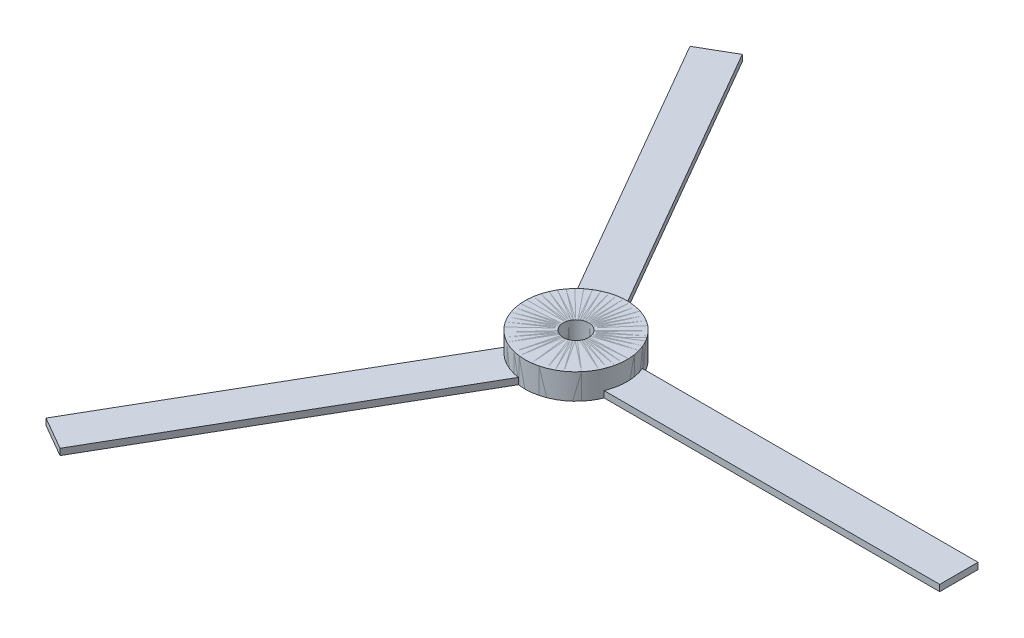
ISO-10303-21;
HEADER;
FILE_DESCRIPTION(('STEP AP214'),'2;1');
FILE_NAME('part.step','',(''),(''),'','','');
FILE_SCHEMA(('AUTOMOTIVE_DESIGN { 1 0 10303 214 1 1 1 1 }'));
ENDSEC;
DATA;
#1=APPLICATION_CONTEXT('core data for automotive mechanical design processes');
#2=APPLICATION_PROTOCOL_DEFINITION('international standard','automotive_design',2000,#1);
#3=PRODUCT_CONTEXT('',#1,'mechanical');
#4=PRODUCT('Part','Part','',(#3));
#5=PRODUCT_RELATED_PRODUCT_CATEGORY('part','',(#4));
#6=PRODUCT_DEFINITION_FORMATION('','',#4);
#7=PRODUCT_DEFINITION_CONTEXT('part definition',#1,'design');
#8=PRODUCT_DEFINITION('design','',#6,#7);
#9=PRODUCT_DEFINITION_SHAPE('','',#8);
#10=(LENGTH_UNIT() NAMED_UNIT(*) SI_UNIT(.MILLI.,.METRE.));
#11=(NAMED_UNIT(*) PLANE_ANGLE_UNIT() SI_UNIT($,.RADIAN.));
#12=(NAMED_UNIT(*) SI_UNIT($,.STERADIAN.) SOLID_ANGLE_UNIT());
#13=UNCERTAINTY_MEASURE_WITH_UNIT(LENGTH_MEASURE(1.E-05),#10,'distance_accuracy_value','');
#14=(GEOMETRIC_REPRESENTATION_CONTEXT(3) GLOBAL_UNCERTAINTY_ASSIGNED_CONTEXT((#13)) GLOBAL_UNIT_ASSIGNED_CONTEXT((#10,
#11,#12)) REPRESENTATION_CONTEXT('',''));
#15=CARTESIAN_POINT('',(0.,0.,0.));
#16=DIRECTION('',(0.,0.,1.));
#17=DIRECTION('',(1.,0.,0.));
#18=AXIS2_PLACEMENT_3D('',#15,#16,#17);
#19=CARTESIAN_POINT('',(0.,0.5,0.));
#20=DIRECTION('',(-0.499999999999992,0.,0.866025403784443));
#21=DIRECTION('',(0.866025403784443,0.,0.499999999999992));
#22=AXIS2_PLACEMENT_3D('',#19,#20,#21);
#23=PLANE('',#22);
#24=DIRECTION('',(-0.866025403784443,0.,-0.499999999999992));
#25=VECTOR('',#24,1.);
#26=CARTESIAN_POINT('',(0.,0.,0.));
#27=LINE('',#26,#25);
#28=CARTESIAN_POINT('',(1.29903810567666,0.,0.749999999999988));
#29=VERTEX_POINT('',#28);
#30=CARTESIAN_POINT('',(0.866025403784444,0.,0.499999999999992));
#31=VERTEX_POINT('',#30);
#32=EDGE_CURVE('E123',#29,#31,#27,.T.);
#33=ORIENTED_EDGE('',*,*,#32,.T.);
#34=DIRECTION('',(0.,1.,0.));
#35=VECTOR('',#34,1.);
#36=CARTESIAN_POINT('',(0.866025403784444,-8.,0.499999999999992));
#37=LINE('',#36,#35);
#38=CARTESIAN_POINT('',(0.866025403784444,0.5,0.499999999999992));
#39=VERTEX_POINT('',#38);
#40=EDGE_CURVE('E61',#31,#39,#37,.T.);
#41=ORIENTED_EDGE('',*,*,#40,.T.);
#42=DIRECTION('',(-0.866025403784443,0.,-0.499999999999992));
#43=VECTOR('',#42,1.);
#44=CARTESIAN_POINT('',(0.,0.5,0.));
#45=LINE('',#44,#43);
#46=CARTESIAN_POINT('',(1.29903810567666,0.5,0.749999999999988));
#47=VERTEX_POINT('',#46);
#48=EDGE_CURVE('E97',#47,#39,#45,.T.);
#49=ORIENTED_EDGE('',*,*,#48,.F.);
#50=DIRECTION('',(0.,-1.,0.));
#51=VECTOR('',#50,1.);
#52=CARTESIAN_POINT('',(1.29903810567666,0.5,0.749999999999988));
#53=LINE('',#52,#51);
#54=EDGE_CURVE('E54',#47,#29,#53,.T.);
#55=ORIENTED_EDGE('',*,*,#54,.T.);
#56=EDGE_LOOP('',(#33,#41,#49,#55));
#57=FACE_BOUND('',#56,.T.);
#58=ADVANCED_FACE('F46',(#57),#23,.F.);
#59=CARTESIAN_POINT('',(1.29903810567666,0.5,0.749999999999988));
#60=DIRECTION('',(-0.866025403784443,0.,-0.499999999999992));
#61=DIRECTION('',(-0.499999999999992,0.,0.866025403784443));
#62=AXIS2_PLACEMENT_3D('',#59,#60,#61);
#63=PLANE('',#62);
#64=DIRECTION('',(0.499999999999992,0.,-0.866025403784443));
#65=VECTOR('',#64,1.);
#66=CARTESIAN_POINT('',(1.29903810567666,0.,0.749999999999988));
#67=LINE('',#66,#65);
#68=CARTESIAN_POINT('',(-13.7009618943231,0.,26.7307621135333));
#69=VERTEX_POINT('',#68);
#70=EDGE_CURVE('E124',#69,#29,#67,.T.);
#71=ORIENTED_EDGE('',*,*,#70,.T.);
#72=ORIENTED_EDGE('',*,*,#54,.F.);
#73=DIRECTION('',(0.499999999999992,0.,-0.866025403784443));
#74=VECTOR('',#73,1.);
#75=CARTESIAN_POINT('',(1.29903810567666,0.5,0.749999999999988));
#76=LINE('',#75,#74);
#77=CARTESIAN_POINT('',(-13.7009618943231,0.5,26.7307621135333));
#78=VERTEX_POINT('',#77);
#79=EDGE_CURVE('E133',#78,#47,#76,.T.);
#80=ORIENTED_EDGE('',*,*,#79,.F.);
#81=DIRECTION('',(0.,-1.,0.));
#82=VECTOR('',#81,1.);
#83=CARTESIAN_POINT('',(-13.7009618943231,0.5,26.7307621135333));
#84=LINE('',#83,#82);
#85=EDGE_CURVE('E134',#78,#69,#84,.T.);
#86=ORIENTED_EDGE('',*,*,#85,.T.);
#87=EDGE_LOOP('',(#71,#72,#80,#86));
#88=FACE_BOUND('',#87,.T.);
#89=ADVANCED_FACE('F48',(#88),#63,.F.);
#90=CARTESIAN_POINT('',(-0.866025403784444,0.5,-0.499999999999992));
#91=VERTEX_POINT('',#90);
#92=CARTESIAN_POINT('',(-1.29903810567666,0.5,-0.749999999999988));
#93=VERTEX_POINT('',#92);
#94=EDGE_CURVE('E118',#91,#93,#45,.T.);
#95=ORIENTED_EDGE('',*,*,#94,.F.);
#96=DIRECTION('',(0.,1.,0.));
#97=VECTOR('',#96,1.);
#98=CARTESIAN_POINT('',(-0.866025403784444,-8.,-0.499999999999992));
#99=LINE('',#98,#97);
#100=CARTESIAN_POINT('',(-0.866025403784444,0.,-0.499999999999992));
#101=VERTEX_POINT('',#100);
#102=EDGE_CURVE('E107',#91,#101,#99,.F.);
#103=ORIENTED_EDGE('',*,*,#102,.T.);
#104=CARTESIAN_POINT('',(-1.29903810567666,0.,-0.749999999999988));
#105=VERTEX_POINT('',#104);
#106=EDGE_CURVE('E116',#101,#105,#27,.T.);
#107=ORIENTED_EDGE('',*,*,#106,.T.);
#108=DIRECTION('',(0.,-1.,0.));
#109=VECTOR('',#108,1.);
#110=CARTESIAN_POINT('',(-1.29903810567666,0.5,-0.749999999999988));
#111=LINE('',#110,#109);
#112=EDGE_CURVE('E138',#93,#105,#111,.T.);
#113=ORIENTED_EDGE('',*,*,#112,.F.);
#114=EDGE_LOOP('',(#95,#103,#107,#113));
#115=FACE_BOUND('',#114,.T.);
#116=ADVANCED_FACE('F114',(#115),#23,.F.);
#117=CARTESIAN_POINT('',(-1.29903810567666,0.5,-0.749999999999988));
#118=DIRECTION('',(0.866025403784443,0.,0.499999999999992));
#119=DIRECTION('',(0.499999999999992,0.,-0.866025403784443));
#120=AXIS2_PLACEMENT_3D('',#117,#118,#119);
#121=PLANE('',#120);
#122=DIRECTION('',(-0.499999999999992,0.,0.866025403784443));
#123=VECTOR('',#122,1.);
#124=CARTESIAN_POINT('',(-1.29903810567666,0.,-0.749999999999988));
#125=LINE('',#124,#123);
#126=CARTESIAN_POINT('',(-16.2990381056764,0.,25.2307621135333));
#127=VERTEX_POINT('',#126);
#128=EDGE_CURVE('E122',#105,#127,#125,.T.);
#129=ORIENTED_EDGE('',*,*,#128,.T.);
#130=DIRECTION('',(0.,-1.,0.));
#131=VECTOR('',#130,1.);
#132=CARTESIAN_POINT('',(-16.2990381056764,0.5,25.2307621135333));
#133=LINE('',#132,#131);
#134=CARTESIAN_POINT('',(-16.2990381056764,0.5,25.2307621135333));
#135=VERTEX_POINT('',#134);
#136=EDGE_CURVE('E136',#135,#127,#133,.T.);
#137=ORIENTED_EDGE('',*,*,#136,.F.);
#138=DIRECTION('',(-0.499999999999992,0.,0.866025403784443));
#139=VECTOR('',#138,1.);
#140=CARTESIAN_POINT('',(-1.29903810567666,0.5,-0.749999999999988));
#141=LINE('',#140,#139);
#142=EDGE_CURVE('E145',#93,#135,#141,.T.);
#143=ORIENTED_EDGE('',*,*,#142,.F.);
#144=ORIENTED_EDGE('',*,*,#112,.T.);
#145=EDGE_LOOP('',(#129,#137,#143,#144));
#146=FACE_BOUND('',#145,.T.);
#147=ADVANCED_FACE('F154',(#146),#121,.F.);
#148=CARTESIAN_POINT('',(-14.9999999999998,0.5,25.9807621135333));
#149=DIRECTION('',(0.499999999999992,0.,-0.866025403784443));
#150=DIRECTION('',(-0.866025403784443,0.,-0.499999999999992));
#151=AXIS2_PLACEMENT_3D('',#148,#149,#150);
#152=PLANE('',#151);
#153=DIRECTION('',(0.866025403784443,0.,0.499999999999992));
#154=VECTOR('',#153,1.);
#155=CARTESIAN_POINT('',(-14.9999999999998,0.,25.9807621135333));
#156=LINE('',#155,#154);
#157=EDGE_CURVE('E90',#127,#69,#156,.T.);
#158=ORIENTED_EDGE('',*,*,#157,.T.);
#159=ORIENTED_EDGE('',*,*,#85,.F.);
#160=DIRECTION('',(0.866025403784443,0.,0.499999999999992));
#161=VECTOR('',#160,1.);
#162=CARTESIAN_POINT('',(-14.9999999999998,0.5,25.9807621135333));
#163=LINE('',#162,#161);
#164=EDGE_CURVE('E69',#135,#78,#163,.T.);
#165=ORIENTED_EDGE('',*,*,#164,.F.);
#166=ORIENTED_EDGE('',*,*,#136,.T.);
#167=EDGE_LOOP('',(#158,#159,#165,#166));
#168=FACE_BOUND('',#167,.T.);
#169=ADVANCED_FACE('F143',(#168),#152,.F.);
#170=CARTESIAN_POINT('',(0.,0.5,0.));
#171=DIRECTION('',(0.,1.,0.));
#172=DIRECTION('',(-0.866025403784443,0.,-0.499999999999992));
#173=AXIS2_PLACEMENT_3D('',#170,#171,#172);
#174=PLANE('',#173);
#175=CARTESIAN_POINT('',(0.,0.5,0.));
#176=DIRECTION('',(0.,1.,0.));
#177=DIRECTION('',(0.,0.,1.));
#178=AXIS2_PLACEMENT_3D('',#175,#176,#177);
#179=CIRCLE('',#178,1.);
#180=EDGE_CURVE('E127',#91,#39,#179,.T.);
#181=ORIENTED_EDGE('',*,*,#180,.F.);
#182=ORIENTED_EDGE('',*,*,#94,.T.);
#183=ORIENTED_EDGE('',*,*,#142,.T.);
#184=ORIENTED_EDGE('',*,*,#164,.T.);
#185=ORIENTED_EDGE('',*,*,#79,.T.);
#186=ORIENTED_EDGE('',*,*,#48,.T.);
#187=EDGE_LOOP('',(#181,#182,#183,#184,#185,#186));
#188=FACE_BOUND('',#187,.T.);
#189=ADVANCED_FACE('F151',(#188),#174,.T.);
#190=CARTESIAN_POINT('',(0.,0.,0.));
#191=DIRECTION('',(0.,1.,0.));
#192=DIRECTION('',(-0.866025403784443,0.,-0.499999999999992));
#193=AXIS2_PLACEMENT_3D('',#190,#191,#192);
#194=PLANE('',#193);
#195=ORIENTED_EDGE('',*,*,#106,.F.);
#196=CARTESIAN_POINT('',(0.,0.,0.));
#197=DIRECTION('',(0.,1.,0.));
#198=DIRECTION('',(0.,0.,1.));
#199=AXIS2_PLACEMENT_3D('',#196,#197,#198);
#200=CIRCLE('',#199,1.);
#201=EDGE_CURVE('E12',#101,#31,#200,.T.);
#202=ORIENTED_EDGE('',*,*,#201,.T.);
#203=ORIENTED_EDGE('',*,*,#32,.F.);
#204=ORIENTED_EDGE('',*,*,#70,.F.);
#205=ORIENTED_EDGE('',*,*,#157,.F.);
#206=ORIENTED_EDGE('',*,*,#128,.F.);
#207=EDGE_LOOP('',(#195,#202,#203,#204,#205,#206));
#208=FACE_BOUND('',#207,.T.);
#209=ADVANCED_FACE('F121',(#208),#194,.F.);
#210=CARTESIAN_POINT('',(0.,-8.,0.));
#211=DIRECTION('',(0.,1.,0.));
#212=DIRECTION('',(0.,0.,1.));
#213=AXIS2_PLACEMENT_3D('',#210,#211,#212);
#214=CYLINDRICAL_SURFACE('',#213,1.);
#215=ORIENTED_EDGE('',*,*,#180,.T.);
#216=ORIENTED_EDGE('',*,*,#40,.F.);
#217=ORIENTED_EDGE('',*,*,#201,.F.);
#218=ORIENTED_EDGE('',*,*,#102,.F.);
#219=EDGE_LOOP('',(#215,#216,#217,#218));
#220=FACE_BOUND('',#219,.T.);
#221=ADVANCED_FACE('F106',(#220),#214,.F.);
#222=CLOSED_SHELL('',(#58,#89,#116,#147,#169,#189,#209,#221));
#223=MANIFOLD_SOLID_BREP('B2',#222);
#224=CARTESIAN_POINT('',(0.,0.5,0.));
#225=DIRECTION('',(-0.500000000000004,0.,-0.866025403784436));
#226=DIRECTION('',(-0.866025403784436,0.,0.500000000000004));
#227=AXIS2_PLACEMENT_3D('',#224,#225,#226);
#228=PLANE('',#227);
#229=DIRECTION('',(0.866025403784436,0.,-0.500000000000004));
#230=VECTOR('',#229,1.);
#231=CARTESIAN_POINT('',(0.,0.,0.));
#232=LINE('',#231,#230);
#233=CARTESIAN_POINT('',(-1.29903810567665,0.,0.750000000000006));
#234=VERTEX_POINT('',#233);
#235=CARTESIAN_POINT('',(-0.866025403784437,0.,0.500000000000005));
#236=VERTEX_POINT('',#235);
#237=EDGE_CURVE('E306',#234,#236,#232,.T.);
#238=ORIENTED_EDGE('',*,*,#237,.T.);
#239=DIRECTION('',(0.,1.,0.));
#240=VECTOR('',#239,1.);
#241=CARTESIAN_POINT('',(-0.866025403784437,-8.,0.500000000000005));
#242=LINE('',#241,#240);
#243=CARTESIAN_POINT('',(-0.866025403784437,0.5,0.500000000000005));
#244=VERTEX_POINT('',#243);
#245=EDGE_CURVE('E244',#236,#244,#242,.T.);
#246=ORIENTED_EDGE('',*,*,#245,.T.);
#247=DIRECTION('',(0.866025403784436,0.,-0.500000000000004));
#248=VECTOR('',#247,1.);
#249=CARTESIAN_POINT('',(0.,0.5,0.));
#250=LINE('',#249,#248);
#251=CARTESIAN_POINT('',(-1.29903810567665,0.5,0.750000000000006));
#252=VERTEX_POINT('',#251);
#253=EDGE_CURVE('E280',#252,#244,#250,.T.);
#254=ORIENTED_EDGE('',*,*,#253,.F.);
#255=DIRECTION('',(0.,-1.,0.));
#256=VECTOR('',#255,1.);
#257=CARTESIAN_POINT('',(-1.29903810567665,0.5,0.750000000000006));
#258=LINE('',#257,#256);
#259=EDGE_CURVE('E237',#252,#234,#258,.T.);
#260=ORIENTED_EDGE('',*,*,#259,.T.);
#261=EDGE_LOOP('',(#238,#246,#254,#260));
#262=FACE_BOUND('',#261,.T.);
#263=ADVANCED_FACE('F229',(#262),#228,.F.);
#264=CARTESIAN_POINT('',(-1.29903810567665,0.5,0.750000000000006));
#265=DIRECTION('',(0.866025403784436,0.,-0.500000000000004));
#266=DIRECTION('',(-0.500000000000004,0.,-0.866025403784436));
#267=AXIS2_PLACEMENT_3D('',#264,#265,#266);
#268=PLANE('',#267);
#269=DIRECTION('',(0.500000000000004,0.,0.866025403784436));
#270=VECTOR('',#269,1.);
#271=CARTESIAN_POINT('',(-1.29903810567665,0.,0.750000000000006));
#272=LINE('',#271,#270);
#273=CARTESIAN_POINT('',(-16.2990381056768,0.,-25.2307621135331));
#274=VERTEX_POINT('',#273);
#275=EDGE_CURVE('E307',#274,#234,#272,.T.);
#276=ORIENTED_EDGE('',*,*,#275,.T.);
#277=ORIENTED_EDGE('',*,*,#259,.F.);
#278=DIRECTION('',(0.500000000000004,0.,0.866025403784436));
#279=VECTOR('',#278,1.);
#280=CARTESIAN_POINT('',(-1.29903810567665,0.5,0.750000000000006));
#281=LINE('',#280,#279);
#282=CARTESIAN_POINT('',(-16.2990381056768,0.5,-25.2307621135331));
#283=VERTEX_POINT('',#282);
#284=EDGE_CURVE('E316',#283,#252,#281,.T.);
#285=ORIENTED_EDGE('',*,*,#284,.F.);
#286=DIRECTION('',(0.,-1.,0.));
#287=VECTOR('',#286,1.);
#288=CARTESIAN_POINT('',(-16.2990381056768,0.5,-25.2307621135331));
#289=LINE('',#288,#287);
#290=EDGE_CURVE('E317',#283,#274,#289,.T.);
#291=ORIENTED_EDGE('',*,*,#290,.T.);
#292=EDGE_LOOP('',(#276,#277,#285,#291));
#293=FACE_BOUND('',#292,.T.);
#294=ADVANCED_FACE('F231',(#293),#268,.F.);
#295=CARTESIAN_POINT('',(0.866025403784437,0.5,-0.500000000000005));
#296=VERTEX_POINT('',#295);
#297=CARTESIAN_POINT('',(1.29903810567665,0.5,-0.750000000000006));
#298=VERTEX_POINT('',#297);
#299=EDGE_CURVE('E301',#296,#298,#250,.T.);
#300=ORIENTED_EDGE('',*,*,#299,.F.);
#301=DIRECTION('',(0.,1.,0.));
#302=VECTOR('',#301,1.);
#303=CARTESIAN_POINT('',(0.866025403784437,-8.,-0.500000000000005));
#304=LINE('',#303,#302);
#305=CARTESIAN_POINT('',(0.866025403784437,0.,-0.500000000000005));
#306=VERTEX_POINT('',#305);
#307=EDGE_CURVE('E290',#296,#306,#304,.F.);
#308=ORIENTED_EDGE('',*,*,#307,.T.);
#309=CARTESIAN_POINT('',(1.29903810567665,0.,-0.750000000000006));
#310=VERTEX_POINT('',#309);
#311=EDGE_CURVE('E299',#306,#310,#232,.T.);
#312=ORIENTED_EDGE('',*,*,#311,.T.);
#313=DIRECTION('',(0.,-1.,0.));
#314=VECTOR('',#313,1.);
#315=CARTESIAN_POINT('',(1.29903810567665,0.5,-0.750000000000006));
#316=LINE('',#315,#314);
#317=EDGE_CURVE('E321',#298,#310,#316,.T.);
#318=ORIENTED_EDGE('',*,*,#317,.F.);
#319=EDGE_LOOP('',(#300,#308,#312,#318));
#320=FACE_BOUND('',#319,.T.);
#321=ADVANCED_FACE('F297',(#320),#228,.F.);
#322=CARTESIAN_POINT('',(1.29903810567665,0.5,-0.750000000000006));
#323=DIRECTION('',(-0.866025403784436,0.,0.500000000000004));
#324=DIRECTION('',(0.500000000000004,0.,0.866025403784436));
#325=AXIS2_PLACEMENT_3D('',#322,#323,#324);
#326=PLANE('',#325);
#327=DIRECTION('',(-0.500000000000004,0.,-0.866025403784436));
#328=VECTOR('',#327,1.);
#329=CARTESIAN_POINT('',(1.29903810567665,0.,-0.750000000000006));
#330=LINE('',#329,#328);
#331=CARTESIAN_POINT('',(-13.7009618943235,0.,-26.7307621135331));
#332=VERTEX_POINT('',#331);
#333=EDGE_CURVE('E305',#310,#332,#330,.T.);
#334=ORIENTED_EDGE('',*,*,#333,.T.);
#335=DIRECTION('',(0.,-1.,0.));
#336=VECTOR('',#335,1.);
#337=CARTESIAN_POINT('',(-13.7009618943235,0.5,-26.7307621135331));
#338=LINE('',#337,#336);
#339=CARTESIAN_POINT('',(-13.7009618943235,0.5,-26.7307621135331));
#340=VERTEX_POINT('',#339);
#341=EDGE_CURVE('E319',#340,#332,#338,.T.);
#342=ORIENTED_EDGE('',*,*,#341,.F.);
#343=DIRECTION('',(-0.500000000000004,0.,-0.866025403784436));
#344=VECTOR('',#343,1.);
#345=CARTESIAN_POINT('',(1.29903810567665,0.5,-0.750000000000006));
#346=LINE('',#345,#344);
#347=EDGE_CURVE('E328',#298,#340,#346,.T.);
#348=ORIENTED_EDGE('',*,*,#347,.F.);
#349=ORIENTED_EDGE('',*,*,#317,.T.);
#350=EDGE_LOOP('',(#334,#342,#348,#349));
#351=FACE_BOUND('',#350,.T.);
#352=ADVANCED_FACE('F337',(#351),#326,.F.);
#353=CARTESIAN_POINT('',(-15.0000000000001,0.5,-25.9807621135331));
#354=DIRECTION('',(0.500000000000004,0.,0.866025403784436));
#355=DIRECTION('',(0.866025403784436,0.,-0.500000000000004));
#356=AXIS2_PLACEMENT_3D('',#353,#354,#355);
#357=PLANE('',#356);
#358=DIRECTION('',(-0.866025403784436,0.,0.500000000000004));
#359=VECTOR('',#358,1.);
#360=CARTESIAN_POINT('',(-15.0000000000001,0.,-25.9807621135331));
#361=LINE('',#360,#359);
#362=EDGE_CURVE('E273',#332,#274,#361,.T.);
#363=ORIENTED_EDGE('',*,*,#362,.T.);
#364=ORIENTED_EDGE('',*,*,#290,.F.);
#365=DIRECTION('',(-0.866025403784436,0.,0.500000000000004));
#366=VECTOR('',#365,1.);
#367=CARTESIAN_POINT('',(-15.0000000000001,0.5,-25.9807621135331));
#368=LINE('',#367,#366);
#369=EDGE_CURVE('E252',#340,#283,#368,.T.);
#370=ORIENTED_EDGE('',*,*,#369,.F.);
#371=ORIENTED_EDGE('',*,*,#341,.T.);
#372=EDGE_LOOP('',(#363,#364,#370,#371));
#373=FACE_BOUND('',#372,.T.);
#374=ADVANCED_FACE('F326',(#373),#357,.F.);
#375=CARTESIAN_POINT('',(0.,0.5,0.));
#376=DIRECTION('',(0.,1.,0.));
#377=DIRECTION('',(0.866025403784436,0.,-0.500000000000004));
#378=AXIS2_PLACEMENT_3D('',#375,#376,#377);
#379=PLANE('',#378);
#380=CARTESIAN_POINT('',(0.,0.5,0.));
#381=DIRECTION('',(0.,1.,0.));
#382=DIRECTION('',(0.,0.,1.));
#383=AXIS2_PLACEMENT_3D('',#380,#381,#382);
#384=CIRCLE('',#383,1.);
#385=EDGE_CURVE('E310',#296,#244,#384,.T.);
#386=ORIENTED_EDGE('',*,*,#385,.F.);
#387=ORIENTED_EDGE('',*,*,#299,.T.);
#388=ORIENTED_EDGE('',*,*,#347,.T.);
#389=ORIENTED_EDGE('',*,*,#369,.T.);
#390=ORIENTED_EDGE('',*,*,#284,.T.);
#391=ORIENTED_EDGE('',*,*,#253,.T.);
#392=EDGE_LOOP('',(#386,#387,#388,#389,#390,#391));
#393=FACE_BOUND('',#392,.T.);
#394=ADVANCED_FACE('F334',(#393),#379,.T.);
#395=CARTESIAN_POINT('',(0.,0.,0.));
#396=DIRECTION('',(0.,1.,0.));
#397=DIRECTION('',(0.866025403784436,0.,-0.500000000000004));
#398=AXIS2_PLACEMENT_3D('',#395,#396,#397);
#399=PLANE('',#398);
#400=ORIENTED_EDGE('',*,*,#311,.F.);
#401=CARTESIAN_POINT('',(0.,0.,0.));
#402=DIRECTION('',(0.,1.,0.));
#403=DIRECTION('',(0.,0.,1.));
#404=AXIS2_PLACEMENT_3D('',#401,#402,#403);
#405=CIRCLE('',#404,1.);
#406=EDGE_CURVE('E44',#306,#236,#405,.T.);
#407=ORIENTED_EDGE('',*,*,#406,.T.);
#408=ORIENTED_EDGE('',*,*,#237,.F.);
#409=ORIENTED_EDGE('',*,*,#275,.F.);
#410=ORIENTED_EDGE('',*,*,#362,.F.);
#411=ORIENTED_EDGE('',*,*,#333,.F.);
#412=EDGE_LOOP('',(#400,#407,#408,#409,#410,#411));
#413=FACE_BOUND('',#412,.T.);
#414=ADVANCED_FACE('F304',(#413),#399,.F.);
#415=CARTESIAN_POINT('',(0.,-8.,0.));
#416=DIRECTION('',(0.,1.,0.));
#417=DIRECTION('',(0.,0.,1.));
#418=AXIS2_PLACEMENT_3D('',#415,#416,#417);
#419=CYLINDRICAL_SURFACE('',#418,1.);
#420=ORIENTED_EDGE('',*,*,#385,.T.);
#421=ORIENTED_EDGE('',*,*,#245,.F.);
#422=ORIENTED_EDGE('',*,*,#406,.F.);
#423=ORIENTED_EDGE('',*,*,#307,.F.);
#424=EDGE_LOOP('',(#420,#421,#422,#423));
#425=FACE_BOUND('',#424,.T.);
#426=ADVANCED_FACE('F289',(#425),#419,.F.);
#427=CLOSED_SHELL('',(#263,#294,#321,#352,#374,#394,#414,#426));
#428=MANIFOLD_SOLID_BREP('B6',#427);
#429=CARTESIAN_POINT('',(0.,0.5,0.));
#430=DIRECTION('',(1.,0.,0.));
#431=DIRECTION('',(0.,0.,-1.));
#432=AXIS2_PLACEMENT_3D('',#429,#430,#431);
#433=PLANE('',#432);
#434=DIRECTION('',(0.,0.,1.));
#435=VECTOR('',#434,1.);
#436=CARTESIAN_POINT('',(0.,0.,0.));
#437=LINE('',#436,#435);
#438=CARTESIAN_POINT('',(0.,0.,-1.5));
#439=VERTEX_POINT('',#438);
#440=CARTESIAN_POINT('',(0.,0.,-1.));
#441=VERTEX_POINT('',#440);
#442=EDGE_CURVE('E487',#439,#441,#437,.T.);
#443=ORIENTED_EDGE('',*,*,#442,.T.);
#444=DIRECTION('',(0.,1.,0.));
#445=VECTOR('',#444,1.);
#446=CARTESIAN_POINT('',(0.,-8.,-1.));
#447=LINE('',#446,#445);
#448=CARTESIAN_POINT('',(0.,0.5,-1.));
#449=VERTEX_POINT('',#448);
#450=EDGE_CURVE('E425',#441,#449,#447,.T.);
#451=ORIENTED_EDGE('',*,*,#450,.T.);
#452=DIRECTION('',(0.,0.,1.));
#453=VECTOR('',#452,1.);
#454=CARTESIAN_POINT('',(0.,0.5,0.));
#455=LINE('',#454,#453);
#456=CARTESIAN_POINT('',(0.,0.5,-1.5));
#457=VERTEX_POINT('',#456);
#458=EDGE_CURVE('E461',#457,#449,#455,.T.);
#459=ORIENTED_EDGE('',*,*,#458,.F.);
#460=DIRECTION('',(0.,-1.,0.));
#461=VECTOR('',#460,1.);
#462=CARTESIAN_POINT('',(0.,0.5,-1.5));
#463=LINE('',#462,#461);
#464=EDGE_CURVE('E418',#457,#439,#463,.T.);
#465=ORIENTED_EDGE('',*,*,#464,.T.);
#466=EDGE_LOOP('',(#443,#451,#459,#465));
#467=FACE_BOUND('',#466,.T.);
#468=ADVANCED_FACE('F410',(#467),#433,.F.);
#469=CARTESIAN_POINT('',(0.,0.5,-1.5));
#470=DIRECTION('',(0.,0.,1.));
#471=DIRECTION('',(1.,0.,0.));
#472=AXIS2_PLACEMENT_3D('',#469,#470,#471);
#473=PLANE('',#472);
#474=DIRECTION('',(-1.,0.,0.));
#475=VECTOR('',#474,1.);
#476=CARTESIAN_POINT('',(0.,0.,-1.5));
#477=LINE('',#476,#475);
#478=CARTESIAN_POINT('',(30.,0.,-1.5));
#479=VERTEX_POINT('',#478);
#480=EDGE_CURVE('E488',#479,#439,#477,.T.);
#481=ORIENTED_EDGE('',*,*,#480,.T.);
#482=ORIENTED_EDGE('',*,*,#464,.F.);
#483=DIRECTION('',(-1.,0.,0.));
#484=VECTOR('',#483,1.);
#485=CARTESIAN_POINT('',(0.,0.5,-1.5));
#486=LINE('',#485,#484);
#487=CARTESIAN_POINT('',(30.,0.5,-1.5));
#488=VERTEX_POINT('',#487);
#489=EDGE_CURVE('E497',#488,#457,#486,.T.);
#490=ORIENTED_EDGE('',*,*,#489,.F.);
#491=DIRECTION('',(0.,-1.,0.));
#492=VECTOR('',#491,1.);
#493=CARTESIAN_POINT('',(30.,0.5,-1.5));
#494=LINE('',#493,#492);
#495=EDGE_CURVE('E498',#488,#479,#494,.T.);
#496=ORIENTED_EDGE('',*,*,#495,.T.);
#497=EDGE_LOOP('',(#481,#482,#490,#496));
#498=FACE_BOUND('',#497,.T.);
#499=ADVANCED_FACE('F412',(#498),#473,.F.);
#500=CARTESIAN_POINT('',(0.,0.5,1.));
#501=VERTEX_POINT('',#500);
#502=CARTESIAN_POINT('',(0.,0.5,1.5));
#503=VERTEX_POINT('',#502);
#504=EDGE_CURVE('E482',#501,#503,#455,.T.);
#505=ORIENTED_EDGE('',*,*,#504,.F.);
#506=DIRECTION('',(0.,1.,0.));
#507=VECTOR('',#506,1.);
#508=CARTESIAN_POINT('',(0.,-8.,1.));
#509=LINE('',#508,#507);
#510=CARTESIAN_POINT('',(0.,0.,1.));
#511=VERTEX_POINT('',#510);
#512=EDGE_CURVE('E471',#501,#511,#509,.F.);
#513=ORIENTED_EDGE('',*,*,#512,.T.);
#514=CARTESIAN_POINT('',(0.,0.,1.5));
#515=VERTEX_POINT('',#514);
#516=EDGE_CURVE('E480',#511,#515,#437,.T.);
#517=ORIENTED_EDGE('',*,*,#516,.T.);
#518=DIRECTION('',(0.,-1.,0.));
#519=VECTOR('',#518,1.);
#520=CARTESIAN_POINT('',(0.,0.5,1.5));
#521=LINE('',#520,#519);
#522=EDGE_CURVE('E502',#503,#515,#521,.T.);
#523=ORIENTED_EDGE('',*,*,#522,.F.);
#524=EDGE_LOOP('',(#505,#513,#517,#523));
#525=FACE_BOUND('',#524,.T.);
#526=ADVANCED_FACE('F478',(#525),#433,.F.);
#527=CARTESIAN_POINT('',(0.,0.5,1.5));
#528=DIRECTION('',(0.,0.,-1.));
#529=DIRECTION('',(-1.,0.,0.));
#530=AXIS2_PLACEMENT_3D('',#527,#528,#529);
#531=PLANE('',#530);
#532=DIRECTION('',(1.,0.,0.));
#533=VECTOR('',#532,1.);
#534=CARTESIAN_POINT('',(0.,0.,1.5));
#535=LINE('',#534,#533);
#536=CARTESIAN_POINT('',(30.,0.,1.5));
#537=VERTEX_POINT('',#536);
#538=EDGE_CURVE('E486',#515,#537,#535,.T.);
#539=ORIENTED_EDGE('',*,*,#538,.T.);
#540=DIRECTION('',(0.,-1.,0.));
#541=VECTOR('',#540,1.);
#542=CARTESIAN_POINT('',(30.,0.5,1.5));
#543=LINE('',#542,#541);
#544=CARTESIAN_POINT('',(30.,0.5,1.5));
#545=VERTEX_POINT('',#544);
#546=EDGE_CURVE('E500',#545,#537,#543,.T.);
#547=ORIENTED_EDGE('',*,*,#546,.F.);
#548=DIRECTION('',(1.,0.,0.));
#549=VECTOR('',#548,1.);
#550=CARTESIAN_POINT('',(0.,0.5,1.5));
#551=LINE('',#550,#549);
#552=EDGE_CURVE('E509',#503,#545,#551,.T.);
#553=ORIENTED_EDGE('',*,*,#552,.F.);
#554=ORIENTED_EDGE('',*,*,#522,.T.);
#555=EDGE_LOOP('',(#539,#547,#553,#554));
#556=FACE_BOUND('',#555,.T.);
#557=ADVANCED_FACE('F518',(#556),#531,.F.);
#558=CARTESIAN_POINT('',(30.,0.5,0.));
#559=DIRECTION('',(-1.,0.,0.));
#560=DIRECTION('',(0.,0.,1.));
#561=AXIS2_PLACEMENT_3D('',#558,#559,#560);
#562=PLANE('',#561);
#563=DIRECTION('',(0.,0.,-1.));
#564=VECTOR('',#563,1.);
#565=CARTESIAN_POINT('',(30.,0.,0.));
#566=LINE('',#565,#564);
#567=EDGE_CURVE('E454',#537,#479,#566,.T.);
#568=ORIENTED_EDGE('',*,*,#567,.T.);
#569=ORIENTED_EDGE('',*,*,#495,.F.);
#570=DIRECTION('',(0.,0.,-1.));
#571=VECTOR('',#570,1.);
#572=CARTESIAN_POINT('',(30.,0.5,0.));
#573=LINE('',#572,#571);
#574=EDGE_CURVE('E433',#545,#488,#573,.T.);
#575=ORIENTED_EDGE('',*,*,#574,.F.);
#576=ORIENTED_EDGE('',*,*,#546,.T.);
#577=EDGE_LOOP('',(#568,#569,#575,#576));
#578=FACE_BOUND('',#577,.T.);
#579=ADVANCED_FACE('F507',(#578),#562,.F.);
#580=CARTESIAN_POINT('',(0.,0.5,0.));
#581=DIRECTION('',(0.,1.,0.));
#582=DIRECTION('',(0.,0.,1.));
#583=AXIS2_PLACEMENT_3D('',#580,#581,#582);
#584=PLANE('',#583);
#585=CARTESIAN_POINT('',(0.,0.5,0.));
#586=DIRECTION('',(0.,1.,0.));
#587=DIRECTION('',(0.,0.,1.));
#588=AXIS2_PLACEMENT_3D('',#585,#586,#587);
#589=CIRCLE('',#588,1.);
#590=EDGE_CURVE('E491',#501,#449,#589,.T.);
#591=ORIENTED_EDGE('',*,*,#590,.F.);
#592=ORIENTED_EDGE('',*,*,#504,.T.);
#593=ORIENTED_EDGE('',*,*,#552,.T.);
#594=ORIENTED_EDGE('',*,*,#574,.T.);
#595=ORIENTED_EDGE('',*,*,#489,.T.);
#596=ORIENTED_EDGE('',*,*,#458,.T.);
#597=EDGE_LOOP('',(#591,#592,#593,#594,#595,#596));
#598=FACE_BOUND('',#597,.T.);
#599=ADVANCED_FACE('F515',(#598),#584,.T.);
#600=CARTESIAN_POINT('',(0.,0.,0.));
#601=DIRECTION('',(0.,1.,0.));
#602=DIRECTION('',(0.,0.,1.));
#603=AXIS2_PLACEMENT_3D('',#600,#601,#602);
#604=PLANE('',#603);
#605=ORIENTED_EDGE('',*,*,#516,.F.);
#606=CARTESIAN_POINT('',(0.,0.,0.));
#607=DIRECTION('',(0.,1.,0.));
#608=DIRECTION('',(0.,0.,1.));
#609=AXIS2_PLACEMENT_3D('',#606,#607,#608);
#610=CIRCLE('',#609,1.);
#611=EDGE_CURVE('E227',#511,#441,#610,.T.);
#612=ORIENTED_EDGE('',*,*,#611,.T.);
#613=ORIENTED_EDGE('',*,*,#442,.F.);
#614=ORIENTED_EDGE('',*,*,#480,.F.);
#615=ORIENTED_EDGE('',*,*,#567,.F.);
#616=ORIENTED_EDGE('',*,*,#538,.F.);
#617=EDGE_LOOP('',(#605,#612,#613,#614,#615,#616));
#618=FACE_BOUND('',#617,.T.);
#619=ADVANCED_FACE('F485',(#618),#604,.F.);
#620=CARTESIAN_POINT('',(0.,-8.,0.));
#621=DIRECTION('',(0.,1.,0.));
#622=DIRECTION('',(0.,0.,1.));
#623=AXIS2_PLACEMENT_3D('',#620,#621,#622);
#624=CYLINDRICAL_SURFACE('',#623,1.);
#625=ORIENTED_EDGE('',*,*,#590,.T.);
#626=ORIENTED_EDGE('',*,*,#450,.F.);
#627=ORIENTED_EDGE('',*,*,#611,.F.);
#628=ORIENTED_EDGE('',*,*,#512,.F.);
#629=EDGE_LOOP('',(#625,#626,#627,#628));
#630=FACE_BOUND('',#629,.T.);
#631=ADVANCED_FACE('F470',(#630),#624,.F.);
#632=CLOSED_SHELL('',(#468,#499,#526,#557,#579,#599,#619,#631));
#633=MANIFOLD_SOLID_BREP('B38',#632);
#634=CARTESIAN_POINT('',(0.,2.,0.));
#635=DIRECTION('',(0.,1.,0.));
#636=DIRECTION('',(-0.866025403784443,0.,-0.499999999999992));
#637=AXIS2_PLACEMENT_3D('',#634,#635,#636);
#638=PLANE('',#637);
#639=CARTESIAN_POINT('',(0.,2.,0.));
#640=DIRECTION('',(0.,1.,0.));
#641=DIRECTION('',(-0.866025403784443,0.,-0.499999999999992));
#642=AXIS2_PLACEMENT_3D('',#639,#640,#641);
#643=CIRCLE('',#642,4.);
#644=CARTESIAN_POINT('',(-3.46410161513777,2.,-1.99999999999997));
#645=VERTEX_POINT('',#644);
#646=EDGE_CURVE('E409',#645,#645,#643,.T.);
#647=ORIENTED_EDGE('',*,*,#646,.T.);
#648=EDGE_LOOP('',(#647));
#649=FACE_BOUND('',#648,.T.);
#650=CARTESIAN_POINT('',(0.,2.,0.));
#651=DIRECTION('',(0.,1.,0.));
#652=DIRECTION('',(-0.866025403784443,0.,-0.499999999999992));
#653=AXIS2_PLACEMENT_3D('',#650,#651,#652);
#654=CIRCLE('',#653,1.);
#655=CARTESIAN_POINT('',(-0.866025403784444,2.,-0.499999999999992));
#656=VERTEX_POINT('',#655);
#657=EDGE_CURVE('E602',#656,#656,#654,.T.);
#658=ORIENTED_EDGE('',*,*,#657,.F.);
#659=EDGE_LOOP('',(#658));
#660=FACE_BOUND('',#659,.T.);
#661=ADVANCED_FACE('F591',(#649,#660),#638,.T.);
#662=CARTESIAN_POINT('',(0.,0.,0.));
#663=DIRECTION('',(0.,1.,0.));
#664=DIRECTION('',(-0.866025403784443,0.,-0.499999999999992));
#665=AXIS2_PLACEMENT_3D('',#662,#663,#664);
#666=PLANE('',#665);
#667=CARTESIAN_POINT('',(0.,0.,0.));
#668=DIRECTION('',(0.,1.,0.));
#669=DIRECTION('',(-0.866025403784443,0.,-0.499999999999992));
#670=AXIS2_PLACEMENT_3D('',#667,#668,#669);
#671=CIRCLE('',#670,4.);
#672=CARTESIAN_POINT('',(-3.46410161513777,0.,-1.99999999999997));
#673=VERTEX_POINT('',#672);
#674=EDGE_CURVE('E595',#673,#673,#671,.T.);
#675=ORIENTED_EDGE('',*,*,#674,.F.);
#676=EDGE_LOOP('',(#675));
#677=FACE_BOUND('',#676,.T.);
#678=CARTESIAN_POINT('',(0.,0.,0.));
#679=DIRECTION('',(0.,1.,0.));
#680=DIRECTION('',(-0.866025403784443,0.,-0.499999999999992));
#681=AXIS2_PLACEMENT_3D('',#678,#679,#680);
#682=CIRCLE('',#681,1.);
#683=CARTESIAN_POINT('',(-0.866025403784444,0.,-0.499999999999992));
#684=VERTEX_POINT('',#683);
#685=EDGE_CURVE('E604',#684,#684,#682,.T.);
#686=ORIENTED_EDGE('',*,*,#685,.T.);
#687=EDGE_LOOP('',(#686));
#688=FACE_BOUND('',#687,.T.);
#689=ADVANCED_FACE('F614',(#677,#688),#666,.F.);
#690=CARTESIAN_POINT('',(0.,2.,0.));
#691=DIRECTION('',(0.,-1.,0.));
#692=DIRECTION('',(0.866025403784443,0.,0.499999999999992));
#693=AXIS2_PLACEMENT_3D('',#690,#691,#692);
#694=CYLINDRICAL_SURFACE('',#693,4.);
#695=ORIENTED_EDGE('',*,*,#646,.F.);
#696=EDGE_LOOP('',(#695));
#697=FACE_BOUND('',#696,.T.);
#698=ORIENTED_EDGE('',*,*,#674,.T.);
#699=EDGE_LOOP('',(#698));
#700=FACE_BOUND('',#699,.T.);
#701=ADVANCED_FACE('F593',(#697,#700),#694,.T.);
#702=CARTESIAN_POINT('',(0.,2.,0.));
#703=DIRECTION('',(0.,-1.,0.));
#704=DIRECTION('',(0.866025403784443,0.,0.499999999999992));
#705=AXIS2_PLACEMENT_3D('',#702,#703,#704);
#706=CYLINDRICAL_SURFACE('',#705,1.);
#707=ORIENTED_EDGE('',*,*,#657,.T.);
#708=EDGE_LOOP('',(#707));
#709=FACE_BOUND('',#708,.T.);
#710=ORIENTED_EDGE('',*,*,#685,.F.);
#711=EDGE_LOOP('',(#710));
#712=FACE_BOUND('',#711,.T.);
#713=ADVANCED_FACE('F610',(#709,#712),#706,.F.);
#714=CLOSED_SHELL('',(#661,#689,#701,#713));
#715=MANIFOLD_SOLID_BREP('B221_NOT_SHOWN',#714);
#716=CARTESIAN_POINT('',(0.,2.,0.));
#717=DIRECTION('',(0.,1.,0.));
#718=DIRECTION('',(0.866025403784436,0.,-0.500000000000004));
#719=AXIS2_PLACEMENT_3D('',#716,#717,#718);
#720=PLANE('',#719);
#721=CARTESIAN_POINT('',(0.,2.,0.));
#722=DIRECTION('',(0.,1.,0.));
#723=DIRECTION('',(0.866025403784436,0.,-0.500000000000004));
#724=AXIS2_PLACEMENT_3D('',#721,#722,#723);
#725=CIRCLE('',#724,4.);
#726=CARTESIAN_POINT('',(3.46410161513775,2.,-2.00000000000002));
#727=VERTEX_POINT('',#726);
#728=EDGE_CURVE('E590',#727,#727,#725,.T.);
#729=ORIENTED_EDGE('',*,*,#728,.T.);
#730=EDGE_LOOP('',(#729));
#731=FACE_BOUND('',#730,.T.);
#732=CARTESIAN_POINT('',(0.,2.,0.));
#733=DIRECTION('',(0.,1.,0.));
#734=DIRECTION('',(0.866025403784436,0.,-0.500000000000004));
#735=AXIS2_PLACEMENT_3D('',#732,#733,#734);
#736=CIRCLE('',#735,1.);
#737=CARTESIAN_POINT('',(0.866025403784437,2.,-0.500000000000005));
#738=VERTEX_POINT('',#737);
#739=EDGE_CURVE('E671',#738,#738,#736,.T.);
#740=ORIENTED_EDGE('',*,*,#739,.F.);
#741=EDGE_LOOP('',(#740));
#742=FACE_BOUND('',#741,.T.);
#743=ADVANCED_FACE('F660',(#731,#742),#720,.T.);
#744=CARTESIAN_POINT('',(0.,0.,0.));
#745=DIRECTION('',(0.,1.,0.));
#746=DIRECTION('',(0.866025403784436,0.,-0.500000000000004));
#747=AXIS2_PLACEMENT_3D('',#744,#745,#746);
#748=PLANE('',#747);
#749=CARTESIAN_POINT('',(0.,0.,0.));
#750=DIRECTION('',(0.,1.,0.));
#751=DIRECTION('',(0.866025403784436,0.,-0.500000000000004));
#752=AXIS2_PLACEMENT_3D('',#749,#750,#751);
#753=CIRCLE('',#752,4.);
#754=CARTESIAN_POINT('',(3.46410161513775,0.,-2.00000000000002));
#755=VERTEX_POINT('',#754);
#756=EDGE_CURVE('E664',#755,#755,#753,.T.);
#757=ORIENTED_EDGE('',*,*,#756,.F.);
#758=EDGE_LOOP('',(#757));
#759=FACE_BOUND('',#758,.T.);
#760=CARTESIAN_POINT('',(0.,0.,0.));
#761=DIRECTION('',(0.,1.,0.));
#762=DIRECTION('',(0.866025403784436,0.,-0.500000000000004));
#763=AXIS2_PLACEMENT_3D('',#760,#761,#762);
#764=CIRCLE('',#763,1.);
#765=CARTESIAN_POINT('',(0.866025403784437,0.,-0.500000000000005));
#766=VERTEX_POINT('',#765);
#767=EDGE_CURVE('E673',#766,#766,#764,.T.);
#768=ORIENTED_EDGE('',*,*,#767,.T.);
#769=EDGE_LOOP('',(#768));
#770=FACE_BOUND('',#769,.T.);
#771=ADVANCED_FACE('F683',(#759,#770),#748,.F.);
#772=CARTESIAN_POINT('',(0.,2.,0.));
#773=DIRECTION('',(0.,-1.,0.));
#774=DIRECTION('',(-0.866025403784436,0.,0.500000000000004));
#775=AXIS2_PLACEMENT_3D('',#772,#773,#774);
#776=CYLINDRICAL_SURFACE('',#775,4.);
#777=ORIENTED_EDGE('',*,*,#728,.F.);
#778=EDGE_LOOP('',(#777));
#779=FACE_BOUND('',#778,.T.);
#780=ORIENTED_EDGE('',*,*,#756,.T.);
#781=EDGE_LOOP('',(#780));
#782=FACE_BOUND('',#781,.T.);
#783=ADVANCED_FACE('F662',(#779,#782),#776,.T.);
#784=CARTESIAN_POINT('',(0.,2.,0.));
#785=DIRECTION('',(0.,-1.,0.));
#786=DIRECTION('',(-0.866025403784436,0.,0.500000000000004));
#787=AXIS2_PLACEMENT_3D('',#784,#785,#786);
#788=CYLINDRICAL_SURFACE('',#787,1.);
#789=ORIENTED_EDGE('',*,*,#739,.T.);
#790=EDGE_LOOP('',(#789));
#791=FACE_BOUND('',#790,.T.);
#792=ORIENTED_EDGE('',*,*,#767,.F.);
#793=EDGE_LOOP('',(#792));
#794=FACE_BOUND('',#793,.T.);
#795=ADVANCED_FACE('F679',(#791,#794),#788,.F.);
#796=CLOSED_SHELL('',(#743,#771,#783,#795));
#797=MANIFOLD_SOLID_BREP('B404_NOT_SHOWN',#796);
#798=CARTESIAN_POINT('',(0.,2.,0.));
#799=DIRECTION('',(0.,1.,0.));
#800=DIRECTION('',(0.,0.,1.));
#801=AXIS2_PLACEMENT_3D('',#798,#799,#800);
#802=PLANE('',#801);
#803=CARTESIAN_POINT('',(0.,2.,0.));
#804=DIRECTION('',(0.,1.,0.));
#805=DIRECTION('',(0.,0.,1.));
#806=AXIS2_PLACEMENT_3D('',#803,#804,#805);
#807=CIRCLE('',#806,4.);
#808=CARTESIAN_POINT('',(0.,2.,4.));
#809=VERTEX_POINT('',#808);
#810=EDGE_CURVE('E659',#809,#809,#807,.T.);
#811=ORIENTED_EDGE('',*,*,#810,.T.);
#812=EDGE_LOOP('',(#811));
#813=FACE_BOUND('',#812,.T.);
#814=CARTESIAN_POINT('',(0.,2.,0.));
#815=DIRECTION('',(0.,1.,0.));
#816=DIRECTION('',(0.,0.,1.));
#817=AXIS2_PLACEMENT_3D('',#814,#815,#816);
#818=CIRCLE('',#817,1.);
#819=CARTESIAN_POINT('',(0.,2.,1.));
#820=VERTEX_POINT('',#819);
#821=EDGE_CURVE('E733',#820,#820,#818,.T.);
#822=ORIENTED_EDGE('',*,*,#821,.F.);
#823=EDGE_LOOP('',(#822));
#824=FACE_BOUND('',#823,.T.);
#825=ADVANCED_FACE('F722',(#813,#824),#802,.T.);
#826=CARTESIAN_POINT('',(0.,0.,0.));
#827=DIRECTION('',(0.,1.,0.));
#828=DIRECTION('',(0.,0.,1.));
#829=AXIS2_PLACEMENT_3D('',#826,#827,#828);
#830=PLANE('',#829);
#831=CARTESIAN_POINT('',(0.,0.,0.));
#832=DIRECTION('',(0.,1.,0.));
#833=DIRECTION('',(0.,0.,1.));
#834=AXIS2_PLACEMENT_3D('',#831,#832,#833);
#835=CIRCLE('',#834,4.);
#836=CARTESIAN_POINT('',(0.,0.,4.));
#837=VERTEX_POINT('',#836);
#838=EDGE_CURVE('E726',#837,#837,#835,.T.);
#839=ORIENTED_EDGE('',*,*,#838,.F.);
#840=EDGE_LOOP('',(#839));
#841=FACE_BOUND('',#840,.T.);
#842=CARTESIAN_POINT('',(0.,0.,0.));
#843=DIRECTION('',(0.,1.,0.));
#844=DIRECTION('',(0.,0.,1.));
#845=AXIS2_PLACEMENT_3D('',#842,#843,#844);
#846=CIRCLE('',#845,1.);
#847=CARTESIAN_POINT('',(0.,0.,1.));
#848=VERTEX_POINT('',#847);
#849=EDGE_CURVE('E735',#848,#848,#846,.T.);
#850=ORIENTED_EDGE('',*,*,#849,.T.);
#851=EDGE_LOOP('',(#850));
#852=FACE_BOUND('',#851,.T.);
#853=ADVANCED_FACE('F745',(#841,#852),#830,.F.);
#854=CARTESIAN_POINT('',(0.,2.,0.));
#855=DIRECTION('',(0.,-1.,0.));
#856=DIRECTION('',(0.,0.,-1.));
#857=AXIS2_PLACEMENT_3D('',#854,#855,#856);
#858=CYLINDRICAL_SURFACE('',#857,4.);
#859=ORIENTED_EDGE('',*,*,#810,.F.);
#860=EDGE_LOOP('',(#859));
#861=FACE_BOUND('',#860,.T.);
#862=ORIENTED_EDGE('',*,*,#838,.T.);
#863=EDGE_LOOP('',(#862));
#864=FACE_BOUND('',#863,.T.);
#865=ADVANCED_FACE('F724',(#861,#864),#858,.T.);
#866=CARTESIAN_POINT('',(0.,2.,0.));
#867=DIRECTION('',(0.,-1.,0.));
#868=DIRECTION('',(0.,0.,-1.));
#869=AXIS2_PLACEMENT_3D('',#866,#867,#868);
#870=CYLINDRICAL_SURFACE('',#869,1.);
#871=ORIENTED_EDGE('',*,*,#821,.T.);
#872=EDGE_LOOP('',(#871));
#873=FACE_BOUND('',#872,.T.);
#874=ORIENTED_EDGE('',*,*,#849,.F.);
#875=EDGE_LOOP('',(#874));
#876=FACE_BOUND('',#875,.T.);
#877=ADVANCED_FACE('F741',(#873,#876),#870,.F.);
#878=CLOSED_SHELL('',(#825,#853,#865,#877));
#879=MANIFOLD_SOLID_BREP('B585',#878);
#880=ADVANCED_BREP_SHAPE_REPRESENTATION('',(#18,#223,#428,#633,#715,#797,#879),#14);
#881=SHAPE_DEFINITION_REPRESENTATION(#9,#880);
ENDSEC;
END-ISO-10303-21;
